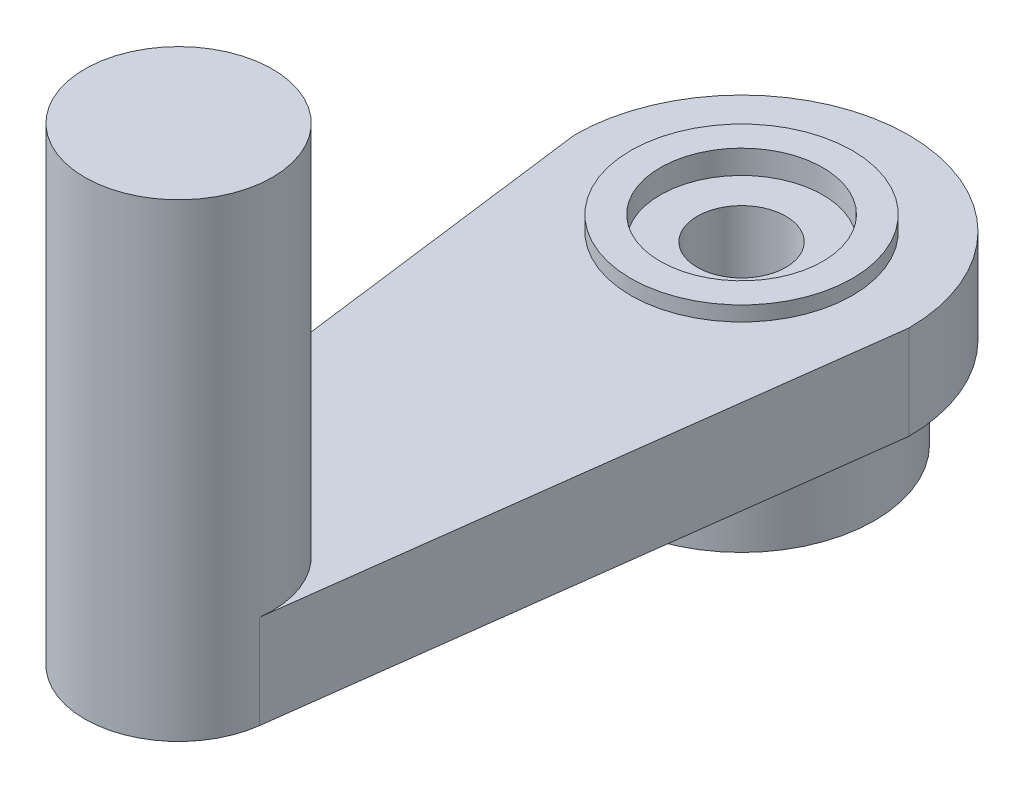
ISO-10303-21;
HEADER;
FILE_DESCRIPTION(('STEP AP214'),'2;1');
FILE_NAME('part.step','',(''),(''),'','','');
FILE_SCHEMA(('AUTOMOTIVE_DESIGN { 1 0 10303 214 1 1 1 1 }'));
ENDSEC;
DATA;
#1=APPLICATION_CONTEXT('core data for automotive mechanical design processes');
#2=APPLICATION_PROTOCOL_DEFINITION('international standard','automotive_design',2000,#1);
#3=PRODUCT_CONTEXT('',#1,'mechanical');
#4=PRODUCT('Part','Part','',(#3));
#5=PRODUCT_RELATED_PRODUCT_CATEGORY('part','',(#4));
#6=PRODUCT_DEFINITION_FORMATION('','',#4);
#7=PRODUCT_DEFINITION_CONTEXT('part definition',#1,'design');
#8=PRODUCT_DEFINITION('design','',#6,#7);
#9=PRODUCT_DEFINITION_SHAPE('','',#8);
#10=(LENGTH_UNIT() NAMED_UNIT(*) SI_UNIT(.MILLI.,.METRE.));
#11=(NAMED_UNIT(*) PLANE_ANGLE_UNIT() SI_UNIT($,.RADIAN.));
#12=(NAMED_UNIT(*) SI_UNIT($,.STERADIAN.) SOLID_ANGLE_UNIT());
#13=UNCERTAINTY_MEASURE_WITH_UNIT(LENGTH_MEASURE(1.E-05),#10,'distance_accuracy_value','');
#14=(GEOMETRIC_REPRESENTATION_CONTEXT(3) GLOBAL_UNCERTAINTY_ASSIGNED_CONTEXT((#13)) GLOBAL_UNIT_ASSIGNED_CONTEXT((#10,
#11,#12)) REPRESENTATION_CONTEXT('',''));
#15=CARTESIAN_POINT('',(0.,0.,0.));
#16=DIRECTION('',(0.,0.,1.));
#17=DIRECTION('',(1.,0.,0.));
#18=AXIS2_PLACEMENT_3D('',#15,#16,#17);
#19=CARTESIAN_POINT('',(0.,3.175,19.05));
#20=DIRECTION('',(0.,1.,0.));
#21=DIRECTION('',(0.,0.,1.));
#22=AXIS2_PLACEMENT_3D('',#19,#20,#21);
#23=PLANE('',#22);
#24=CARTESIAN_POINT('',(0.,3.175,0.));
#25=DIRECTION('',(0.,1.,0.));
#26=DIRECTION('',(0.,0.,1.));
#27=AXIS2_PLACEMENT_3D('',#24,#25,#26);
#28=CIRCLE('',#27,3.75);
#29=CARTESIAN_POINT('',(0.,3.175,3.75));
#30=VERTEX_POINT('',#29);
#31=EDGE_CURVE('E120',#30,#30,#28,.T.);
#32=ORIENTED_EDGE('',*,*,#31,.F.);
#33=EDGE_LOOP('',(#32));
#34=FACE_BOUND('',#33,.T.);
#35=DIRECTION('',(0.127844381121432,0.,0.991794239858086));
#36=VECTOR('',#35,1.);
#37=CARTESIAN_POINT('',(-5.65685424949238,3.175,0.));
#38=LINE('',#37,#36);
#39=CARTESIAN_POINT('',(-5.65685424949238,3.175,0.));
#40=VERTEX_POINT('',#39);
#41=CARTESIAN_POINT('',(-3.14894671154942,3.175,19.4559059100605));
#42=VERTEX_POINT('',#41);
#43=EDGE_CURVE('E51',#40,#42,#38,.T.);
#44=ORIENTED_EDGE('',*,*,#43,.T.);
#45=CARTESIAN_POINT('',(0.,3.175,19.05));
#46=DIRECTION('',(0.,1.,0.));
#47=DIRECTION('',(0.,0.,1.));
#48=AXIS2_PLACEMENT_3D('',#45,#46,#47);
#49=CIRCLE('',#48,3.175);
#50=CARTESIAN_POINT('',(3.14894671154943,3.175,19.4559059100605));
#51=VERTEX_POINT('',#50);
#52=EDGE_CURVE('E89',#51,#42,#49,.T.);
#53=ORIENTED_EDGE('',*,*,#52,.F.);
#54=DIRECTION('',(0.127844381121432,0.,-0.991794239858086));
#55=VECTOR('',#54,1.);
#56=CARTESIAN_POINT('',(5.65685424949238,3.175,0.));
#57=LINE('',#56,#55);
#58=CARTESIAN_POINT('',(5.65685424949238,3.175,0.));
#59=VERTEX_POINT('',#58);
#60=EDGE_CURVE('E78',#51,#59,#57,.T.);
#61=ORIENTED_EDGE('',*,*,#60,.T.);
#62=CARTESIAN_POINT('',(0.,3.175,0.));
#63=DIRECTION('',(0.,1.,0.));
#64=DIRECTION('',(0.,0.,-1.));
#65=AXIS2_PLACEMENT_3D('',#62,#63,#64);
#66=CIRCLE('',#65,5.65685424949238);
#67=EDGE_CURVE('E98',#59,#40,#66,.T.);
#68=ORIENTED_EDGE('',*,*,#67,.T.);
#69=EDGE_LOOP('',(#44,#53,#61,#68));
#70=FACE_BOUND('',#69,.T.);
#71=ADVANCED_FACE('F34',(#34,#70),#23,.T.);
#72=CARTESIAN_POINT('',(0.,0.,19.05));
#73=DIRECTION('',(0.,1.,0.));
#74=DIRECTION('',(0.,0.,1.));
#75=AXIS2_PLACEMENT_3D('',#72,#73,#74);
#76=PLANE('',#75);
#77=CARTESIAN_POINT('',(0.,0.,0.));
#78=DIRECTION('',(0.,1.,0.));
#79=DIRECTION('',(0.,0.,1.));
#80=AXIS2_PLACEMENT_3D('',#77,#78,#79);
#81=CIRCLE('',#80,1.5);
#82=CARTESIAN_POINT('',(0.,0.,1.5));
#83=VERTEX_POINT('',#82);
#84=EDGE_CURVE('E124',#83,#83,#81,.T.);
#85=ORIENTED_EDGE('',*,*,#84,.T.);
#86=EDGE_LOOP('',(#85));
#87=FACE_BOUND('',#86,.T.);
#88=CARTESIAN_POINT('',(0.,0.,0.));
#89=DIRECTION('',(0.,1.,0.));
#90=DIRECTION('',(0.,0.,1.));
#91=AXIS2_PLACEMENT_3D('',#88,#89,#90);
#92=CIRCLE('',#91,2.875);
#93=CARTESIAN_POINT('',(0.,0.,2.875));
#94=VERTEX_POINT('',#93);
#95=EDGE_CURVE('E103',#94,#94,#92,.F.);
#96=ORIENTED_EDGE('',*,*,#95,.T.);
#97=EDGE_LOOP('',(#96));
#98=FACE_BOUND('',#97,.T.);
#99=ADVANCED_FACE('F158',(#87,#98),#76,.F.);
#100=CARTESIAN_POINT('',(0.,3.175,0.));
#101=DIRECTION('',(0.,-1.,0.));
#102=DIRECTION('',(0.,0.,-1.));
#103=AXIS2_PLACEMENT_3D('',#100,#101,#102);
#104=CYLINDRICAL_SURFACE('',#103,1.5);
#105=ORIENTED_EDGE('',*,*,#84,.F.);
#106=EDGE_LOOP('',(#105));
#107=FACE_BOUND('',#106,.T.);
#108=CARTESIAN_POINT('',(0.,2.875,0.));
#109=DIRECTION('',(0.,1.,0.));
#110=DIRECTION('',(0.,0.,1.));
#111=AXIS2_PLACEMENT_3D('',#108,#109,#110);
#112=CIRCLE('',#111,1.5);
#113=CARTESIAN_POINT('',(0.,2.875,1.5));
#114=VERTEX_POINT('',#113);
#115=EDGE_CURVE('E111',#114,#114,#112,.T.);
#116=ORIENTED_EDGE('',*,*,#115,.T.);
#117=EDGE_LOOP('',(#116));
#118=FACE_BOUND('',#117,.T.);
#119=ADVANCED_FACE('F164',(#107,#118),#104,.F.);
#120=CARTESIAN_POINT('',(0.,0.,0.));
#121=DIRECTION('',(0.,1.,0.));
#122=DIRECTION('',(0.,0.,1.));
#123=AXIS2_PLACEMENT_3D('',#120,#121,#122);
#124=CIRCLE('',#123,4.5);
#125=CARTESIAN_POINT('',(0.,0.,4.5));
#126=VERTEX_POINT('',#125);
#127=EDGE_CURVE('E93',#126,#126,#124,.F.);
#128=ORIENTED_EDGE('',*,*,#127,.F.);
#129=EDGE_LOOP('',(#128));
#130=FACE_BOUND('',#129,.T.);
#131=CARTESIAN_POINT('',(0.,0.,19.05));
#132=DIRECTION('',(0.,1.,0.));
#133=DIRECTION('',(0.,0.,1.));
#134=AXIS2_PLACEMENT_3D('',#131,#132,#133);
#135=CIRCLE('',#134,3.175);
#136=CARTESIAN_POINT('',(-3.14894671154942,0.,19.4559059100605));
#137=VERTEX_POINT('',#136);
#138=CARTESIAN_POINT('',(3.14894671154942,0.,19.4559059100605));
#139=VERTEX_POINT('',#138);
#140=EDGE_CURVE('E91',#137,#139,#135,.T.);
#141=ORIENTED_EDGE('',*,*,#140,.F.);
#142=DIRECTION('',(0.127844381121432,0.,0.991794239858086));
#143=VECTOR('',#142,1.);
#144=CARTESIAN_POINT('',(-5.65685424949238,0.,0.));
#145=LINE('',#144,#143);
#146=CARTESIAN_POINT('',(-5.65685424949238,0.,0.));
#147=VERTEX_POINT('',#146);
#148=EDGE_CURVE('E74',#147,#137,#145,.T.);
#149=ORIENTED_EDGE('',*,*,#148,.F.);
#150=CARTESIAN_POINT('',(0.,0.,0.));
#151=DIRECTION('',(0.,1.,0.));
#152=DIRECTION('',(0.,0.,-1.));
#153=AXIS2_PLACEMENT_3D('',#150,#151,#152);
#154=CIRCLE('',#153,5.65685424949238);
#155=CARTESIAN_POINT('',(5.65685424949238,0.,0.));
#156=VERTEX_POINT('',#155);
#157=EDGE_CURVE('E69',#156,#147,#154,.T.);
#158=ORIENTED_EDGE('',*,*,#157,.F.);
#159=DIRECTION('',(0.127844381121432,0.,-0.991794239858086));
#160=VECTOR('',#159,1.);
#161=CARTESIAN_POINT('',(5.65685424949238,0.,0.));
#162=LINE('',#161,#160);
#163=EDGE_CURVE('E133',#139,#156,#162,.T.);
#164=ORIENTED_EDGE('',*,*,#163,.F.);
#165=EDGE_LOOP('',(#141,#149,#158,#164));
#166=FACE_BOUND('',#165,.T.);
#167=ADVANCED_FACE('F167',(#130,#166),#76,.F.);
#168=CARTESIAN_POINT('',(0.,3.175,19.05));
#169=DIRECTION('',(0.,-1.,0.));
#170=DIRECTION('',(0.,0.,-1.));
#171=AXIS2_PLACEMENT_3D('',#168,#169,#170);
#172=CYLINDRICAL_SURFACE('',#171,3.175);
#173=ORIENTED_EDGE('',*,*,#140,.T.);
#174=DIRECTION('',(0.,-1.,0.));
#175=VECTOR('',#174,1.);
#176=CARTESIAN_POINT('',(3.14894671154942,3.175,19.4559059100605));
#177=LINE('',#176,#175);
#178=EDGE_CURVE('E86',#51,#139,#177,.T.);
#179=ORIENTED_EDGE('',*,*,#178,.F.);
#180=ORIENTED_EDGE('',*,*,#52,.T.);
#181=DIRECTION('',(0.,-1.,0.));
#182=VECTOR('',#181,1.);
#183=CARTESIAN_POINT('',(-3.14894671154942,3.175,19.4559059100605));
#184=LINE('',#183,#182);
#185=EDGE_CURVE('E131',#42,#137,#184,.T.);
#186=ORIENTED_EDGE('',*,*,#185,.T.);
#187=EDGE_LOOP('',(#173,#179,#180,#186));
#188=FACE_BOUND('',#187,.T.);
#189=CARTESIAN_POINT('',(0.,15.875,19.05));
#190=DIRECTION('',(0.,1.,0.));
#191=DIRECTION('',(0.,0.,1.));
#192=AXIS2_PLACEMENT_3D('',#189,#190,#191);
#193=CIRCLE('',#192,3.175);
#194=CARTESIAN_POINT('',(0.,15.875,22.225));
#195=VERTEX_POINT('',#194);
#196=EDGE_CURVE('E100',#195,#195,#193,.T.);
#197=ORIENTED_EDGE('',*,*,#196,.F.);
#198=EDGE_LOOP('',(#197));
#199=FACE_BOUND('',#198,.T.);
#200=ADVANCED_FACE('F87',(#188,#199),#172,.T.);
#201=CARTESIAN_POINT('',(5.65685424949238,3.175,0.));
#202=DIRECTION('',(-0.991794239858086,0.,-0.127844381121432));
#203=DIRECTION('',(-0.127844381121432,0.,0.991794239858086));
#204=AXIS2_PLACEMENT_3D('',#201,#202,#203);
#205=PLANE('',#204);
#206=ORIENTED_EDGE('',*,*,#163,.T.);
#207=DIRECTION('',(0.,-1.,0.));
#208=VECTOR('',#207,1.);
#209=CARTESIAN_POINT('',(5.65685424949238,3.175,0.));
#210=LINE('',#209,#208);
#211=EDGE_CURVE('E94',#59,#156,#210,.T.);
#212=ORIENTED_EDGE('',*,*,#211,.F.);
#213=ORIENTED_EDGE('',*,*,#60,.F.);
#214=ORIENTED_EDGE('',*,*,#178,.T.);
#215=EDGE_LOOP('',(#206,#212,#213,#214));
#216=FACE_BOUND('',#215,.T.);
#217=ADVANCED_FACE('F96',(#216),#205,.F.);
#218=CARTESIAN_POINT('',(0.,3.175,0.));
#219=DIRECTION('',(0.,-1.,0.));
#220=DIRECTION('',(0.,0.,-1.));
#221=AXIS2_PLACEMENT_3D('',#218,#219,#220);
#222=CYLINDRICAL_SURFACE('',#221,5.65685424949238);
#223=ORIENTED_EDGE('',*,*,#157,.T.);
#224=DIRECTION('',(0.,-1.,0.));
#225=VECTOR('',#224,1.);
#226=CARTESIAN_POINT('',(-5.65685424949238,3.175,0.));
#227=LINE('',#226,#225);
#228=EDGE_CURVE('E138',#40,#147,#227,.T.);
#229=ORIENTED_EDGE('',*,*,#228,.F.);
#230=ORIENTED_EDGE('',*,*,#67,.F.);
#231=ORIENTED_EDGE('',*,*,#211,.T.);
#232=EDGE_LOOP('',(#223,#229,#230,#231));
#233=FACE_BOUND('',#232,.T.);
#234=ADVANCED_FACE('F178',(#233),#222,.T.);
#235=CARTESIAN_POINT('',(-5.65685424949238,3.175,0.));
#236=DIRECTION('',(0.991794239858086,0.,-0.127844381121432));
#237=DIRECTION('',(-0.127844381121432,0.,-0.991794239858086));
#238=AXIS2_PLACEMENT_3D('',#235,#236,#237);
#239=PLANE('',#238);
#240=ORIENTED_EDGE('',*,*,#148,.T.);
#241=ORIENTED_EDGE('',*,*,#185,.F.);
#242=ORIENTED_EDGE('',*,*,#43,.F.);
#243=ORIENTED_EDGE('',*,*,#228,.T.);
#244=EDGE_LOOP('',(#240,#241,#242,#243));
#245=FACE_BOUND('',#244,.T.);
#246=ADVANCED_FACE('F174',(#245),#239,.F.);
#247=CARTESIAN_POINT('',(0.,3.675,0.));
#248=DIRECTION('',(0.,1.,0.));
#249=DIRECTION('',(0.,0.,1.));
#250=AXIS2_PLACEMENT_3D('',#247,#248,#249);
#251=PLANE('',#250);
#252=CARTESIAN_POINT('',(0.,3.675,0.));
#253=DIRECTION('',(0.,1.,0.));
#254=DIRECTION('',(0.,0.,1.));
#255=AXIS2_PLACEMENT_3D('',#252,#253,#254);
#256=CIRCLE('',#255,3.75);
#257=CARTESIAN_POINT('',(0.,3.675,3.75));
#258=VERTEX_POINT('',#257);
#259=EDGE_CURVE('E121',#258,#258,#256,.T.);
#260=ORIENTED_EDGE('',*,*,#259,.T.);
#261=EDGE_LOOP('',(#260));
#262=FACE_BOUND('',#261,.T.);
#263=CARTESIAN_POINT('',(0.,3.675,0.));
#264=DIRECTION('',(0.,1.,0.));
#265=DIRECTION('',(0.,0.,1.));
#266=AXIS2_PLACEMENT_3D('',#263,#264,#265);
#267=CIRCLE('',#266,2.75);
#268=CARTESIAN_POINT('',(0.,3.675,2.75));
#269=VERTEX_POINT('',#268);
#270=EDGE_CURVE('E117',#269,#269,#267,.T.);
#271=ORIENTED_EDGE('',*,*,#270,.F.);
#272=EDGE_LOOP('',(#271));
#273=FACE_BOUND('',#272,.T.);
#274=ADVANCED_FACE('F177',(#262,#273),#251,.T.);
#275=CARTESIAN_POINT('',(0.,3.675,0.));
#276=DIRECTION('',(0.,-1.,0.));
#277=DIRECTION('',(0.,0.,-1.));
#278=AXIS2_PLACEMENT_3D('',#275,#276,#277);
#279=CYLINDRICAL_SURFACE('',#278,3.75);
#280=ORIENTED_EDGE('',*,*,#259,.F.);
#281=EDGE_LOOP('',(#280));
#282=FACE_BOUND('',#281,.T.);
#283=ORIENTED_EDGE('',*,*,#31,.T.);
#284=EDGE_LOOP('',(#283));
#285=FACE_BOUND('',#284,.T.);
#286=ADVANCED_FACE('F207',(#282,#285),#279,.T.);
#287=CARTESIAN_POINT('',(0.,3.675,0.));
#288=DIRECTION('',(0.,-1.,0.));
#289=DIRECTION('',(0.,0.,-1.));
#290=AXIS2_PLACEMENT_3D('',#287,#288,#289);
#291=CYLINDRICAL_SURFACE('',#290,2.75);
#292=ORIENTED_EDGE('',*,*,#270,.T.);
#293=EDGE_LOOP('',(#292));
#294=FACE_BOUND('',#293,.T.);
#295=CARTESIAN_POINT('',(0.,2.875,0.));
#296=DIRECTION('',(0.,1.,0.));
#297=DIRECTION('',(0.,0.,1.));
#298=AXIS2_PLACEMENT_3D('',#295,#296,#297);
#299=CIRCLE('',#298,2.75);
#300=CARTESIAN_POINT('',(0.,2.875,2.75));
#301=VERTEX_POINT('',#300);
#302=EDGE_CURVE('E114',#301,#301,#299,.F.);
#303=ORIENTED_EDGE('',*,*,#302,.T.);
#304=EDGE_LOOP('',(#303));
#305=FACE_BOUND('',#304,.T.);
#306=ADVANCED_FACE('F215',(#294,#305),#291,.F.);
#307=CARTESIAN_POINT('',(0.,2.875,0.));
#308=DIRECTION('',(0.,1.,0.));
#309=DIRECTION('',(0.,0.,1.));
#310=AXIS2_PLACEMENT_3D('',#307,#308,#309);
#311=PLANE('',#310);
#312=ORIENTED_EDGE('',*,*,#115,.F.);
#313=EDGE_LOOP('',(#312));
#314=FACE_BOUND('',#313,.T.);
#315=ORIENTED_EDGE('',*,*,#302,.F.);
#316=EDGE_LOOP('',(#315));
#317=FACE_BOUND('',#316,.T.);
#318=ADVANCED_FACE('F223',(#314,#317),#311,.T.);
#319=CARTESIAN_POINT('',(0.,-3.048,0.));
#320=DIRECTION('',(0.,-1.,0.));
#321=DIRECTION('',(0.,0.,-1.));
#322=AXIS2_PLACEMENT_3D('',#319,#320,#321);
#323=PLANE('',#322);
#324=CARTESIAN_POINT('',(0.,-3.048,0.));
#325=DIRECTION('',(0.,-1.,0.));
#326=DIRECTION('',(0.,0.,-1.));
#327=AXIS2_PLACEMENT_3D('',#324,#325,#326);
#328=CIRCLE('',#327,3.383);
#329=CARTESIAN_POINT('',(0.,-3.048,-3.383));
#330=VERTEX_POINT('',#329);
#331=EDGE_CURVE('E11',#330,#330,#328,.F.);
#332=ORIENTED_EDGE('',*,*,#331,.T.);
#333=EDGE_LOOP('',(#332));
#334=FACE_BOUND('',#333,.T.);
#335=CARTESIAN_POINT('',(0.,-3.048,0.));
#336=DIRECTION('',(0.,-1.,0.));
#337=DIRECTION('',(0.,0.,-1.));
#338=AXIS2_PLACEMENT_3D('',#335,#336,#337);
#339=CIRCLE('',#338,4.5);
#340=CARTESIAN_POINT('',(0.,-3.048,-4.5));
#341=VERTEX_POINT('',#340);
#342=EDGE_CURVE('E108',#341,#341,#339,.T.);
#343=ORIENTED_EDGE('',*,*,#342,.T.);
#344=EDGE_LOOP('',(#343));
#345=FACE_BOUND('',#344,.T.);
#346=ADVANCED_FACE('F231',(#334,#345),#323,.T.);
#347=CARTESIAN_POINT('',(0.,-3.048,0.));
#348=DIRECTION('',(0.,1.,0.));
#349=DIRECTION('',(0.,0.,1.));
#350=AXIS2_PLACEMENT_3D('',#347,#348,#349);
#351=CYLINDRICAL_SURFACE('',#350,4.5);
#352=ORIENTED_EDGE('',*,*,#342,.F.);
#353=EDGE_LOOP('',(#352));
#354=FACE_BOUND('',#353,.T.);
#355=ORIENTED_EDGE('',*,*,#127,.T.);
#356=EDGE_LOOP('',(#355));
#357=FACE_BOUND('',#356,.T.);
#358=ADVANCED_FACE('F239',(#354,#357),#351,.T.);
#359=CARTESIAN_POINT('',(0.,8.13172798364529,0.));
#360=DIRECTION('',(0.,-1.,0.));
#361=DIRECTION('',(0.,0.,-1.));
#362=AXIS2_PLACEMENT_3D('',#359,#360,#361);
#363=CYLINDRICAL_SURFACE('',#362,2.875);
#364=CARTESIAN_POINT('',(0.,-2.54,0.));
#365=DIRECTION('',(0.,-1.,0.));
#366=DIRECTION('',(0.,0.,-1.));
#367=AXIS2_PLACEMENT_3D('',#364,#365,#366);
#368=CIRCLE('',#367,2.875);
#369=CARTESIAN_POINT('',(0.,-2.54,-2.875));
#370=VERTEX_POINT('',#369);
#371=EDGE_CURVE('E43',#370,#370,#368,.T.);
#372=ORIENTED_EDGE('',*,*,#371,.T.);
#373=EDGE_LOOP('',(#372));
#374=FACE_BOUND('',#373,.T.);
#375=ORIENTED_EDGE('',*,*,#95,.F.);
#376=EDGE_LOOP('',(#375));
#377=FACE_BOUND('',#376,.T.);
#378=ADVANCED_FACE('F145',(#374,#377),#363,.F.);
#379=CARTESIAN_POINT('',(0.,15.875,19.05));
#380=DIRECTION('',(0.,1.,0.));
#381=DIRECTION('',(0.,0.,1.));
#382=AXIS2_PLACEMENT_3D('',#379,#380,#381);
#383=PLANE('',#382);
#384=ORIENTED_EDGE('',*,*,#196,.T.);
#385=EDGE_LOOP('',(#384));
#386=FACE_BOUND('',#385,.T.);
#387=ADVANCED_FACE('F149',(#386),#383,.T.);
#388=CARTESIAN_POINT('',(0.,-2.54,0.));
#389=DIRECTION('',(0.,-1.,0.));
#390=DIRECTION('',(0.,0.,-1.));
#391=AXIS2_PLACEMENT_3D('',#388,#389,#390);
#392=TOROIDAL_SURFACE('',#391,3.383,0.508);
#393=ORIENTED_EDGE('',*,*,#331,.F.);
#394=EDGE_LOOP('',(#393));
#395=FACE_BOUND('',#394,.T.);
#396=ORIENTED_EDGE('',*,*,#371,.F.);
#397=EDGE_LOOP('',(#396));
#398=FACE_BOUND('',#397,.T.);
#399=ADVANCED_FACE('F36',(#395,#398),#392,.T.);
#400=CLOSED_SHELL('',(#71,#99,#119,#167,#200,#217,#234,#246,#274,#286,#306,#318,#346,#358,#378,
#387,#399));
#401=MANIFOLD_SOLID_BREP('B2',#400);
#402=ADVANCED_BREP_SHAPE_REPRESENTATION('',(#18,#401),#14);
#403=SHAPE_DEFINITION_REPRESENTATION(#9,#402);
ENDSEC;
END-ISO-10303-21;
